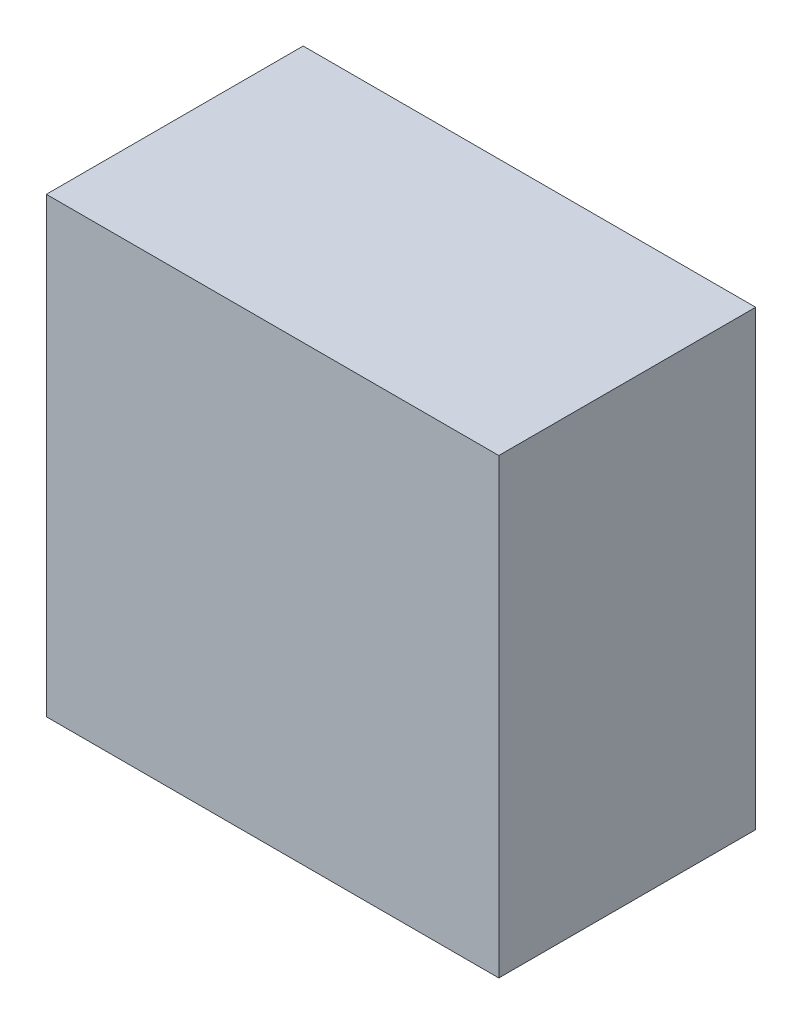
ISO-10303-21;
HEADER;
FILE_DESCRIPTION(('STEP AP214'),'2;1');
FILE_NAME('part.step','',(''),(''),'','','');
FILE_SCHEMA(('AUTOMOTIVE_DESIGN { 1 0 10303 214 1 1 1 1 }'));
ENDSEC;
DATA;
#1=APPLICATION_CONTEXT('core data for automotive mechanical design processes');
#2=APPLICATION_PROTOCOL_DEFINITION('international standard','automotive_design',2000,#1);
#3=PRODUCT_CONTEXT('',#1,'mechanical');
#4=PRODUCT('Part','Part','',(#3));
#5=PRODUCT_RELATED_PRODUCT_CATEGORY('part','',(#4));
#6=PRODUCT_DEFINITION_FORMATION('','',#4);
#7=PRODUCT_DEFINITION_CONTEXT('part definition',#1,'design');
#8=PRODUCT_DEFINITION('design','',#6,#7);
#9=PRODUCT_DEFINITION_SHAPE('','',#8);
#10=(LENGTH_UNIT() NAMED_UNIT(*) SI_UNIT(.MILLI.,.METRE.));
#11=(NAMED_UNIT(*) PLANE_ANGLE_UNIT() SI_UNIT($,.RADIAN.));
#12=(NAMED_UNIT(*) SI_UNIT($,.STERADIAN.) SOLID_ANGLE_UNIT());
#13=UNCERTAINTY_MEASURE_WITH_UNIT(LENGTH_MEASURE(1.E-05),#10,'distance_accuracy_value','');
#14=(GEOMETRIC_REPRESENTATION_CONTEXT(3) GLOBAL_UNCERTAINTY_ASSIGNED_CONTEXT((#13)) GLOBAL_UNIT_ASSIGNED_CONTEXT((#10,
#11,#12)) REPRESENTATION_CONTEXT('',''));
#15=CARTESIAN_POINT('',(0.,0.,0.));
#16=DIRECTION('',(0.,0.,1.));
#17=DIRECTION('',(1.,0.,0.));
#18=AXIS2_PLACEMENT_3D('',#15,#16,#17);
#19=CARTESIAN_POINT('',(-3.12699908,-3.12699908,3.55));
#20=DIRECTION('',(0.,0.,1.));
#21=DIRECTION('',(1.,0.,0.));
#22=AXIS2_PLACEMENT_3D('',#19,#20,#21);
#23=PLANE('',#22);
#24=DIRECTION('',(1.,0.,0.));
#25=VECTOR('',#24,1.);
#26=CARTESIAN_POINT('',(-3.12699908,3.12699908,3.55));
#27=LINE('',#26,#25);
#28=CARTESIAN_POINT('',(-3.12699908,3.12699908,3.55));
#29=VERTEX_POINT('',#28);
#30=CARTESIAN_POINT('',(3.12699908,3.12699908,3.55));
#31=VERTEX_POINT('',#30);
#32=EDGE_CURVE('E52',#29,#31,#27,.T.);
#33=ORIENTED_EDGE('',*,*,#32,.F.);
#34=DIRECTION('',(0.,1.,0.));
#35=VECTOR('',#34,1.);
#36=CARTESIAN_POINT('',(-3.12699908,-3.12699908,3.55));
#37=LINE('',#36,#35);
#38=CARTESIAN_POINT('',(-3.12699908,-3.12699908,3.55));
#39=VERTEX_POINT('',#38);
#40=EDGE_CURVE('E67',#39,#29,#37,.T.);
#41=ORIENTED_EDGE('',*,*,#40,.F.);
#42=DIRECTION('',(1.,0.,0.));
#43=VECTOR('',#42,1.);
#44=CARTESIAN_POINT('',(3.12699908,-3.12699908,3.55));
#45=LINE('',#44,#43);
#46=CARTESIAN_POINT('',(3.12699908,-3.12699908,3.55));
#47=VERTEX_POINT('',#46);
#48=EDGE_CURVE('E19',#47,#39,#45,.F.);
#49=ORIENTED_EDGE('',*,*,#48,.F.);
#50=DIRECTION('',(0.,1.,0.));
#51=VECTOR('',#50,1.);
#52=CARTESIAN_POINT('',(3.12699908,3.12699908,3.55));
#53=LINE('',#52,#51);
#54=EDGE_CURVE('E57',#31,#47,#53,.F.);
#55=ORIENTED_EDGE('',*,*,#54,.F.);
#56=EDGE_LOOP('',(#33,#41,#49,#55));
#57=FACE_BOUND('',#56,.T.);
#58=ADVANCED_FACE('F16',(#57),#23,.T.);
#59=CARTESIAN_POINT('',(3.12699908,-3.12699908,0.));
#60=DIRECTION('',(0.,-1.,0.));
#61=DIRECTION('',(0.,0.,-1.));
#62=AXIS2_PLACEMENT_3D('',#59,#60,#61);
#63=PLANE('',#62);
#64=DIRECTION('',(0.,0.,1.));
#65=VECTOR('',#64,1.);
#66=CARTESIAN_POINT('',(-3.12699908,-3.12699908,0.));
#67=LINE('',#66,#65);
#68=CARTESIAN_POINT('',(-3.12699908,-3.12699908,0.));
#69=VERTEX_POINT('',#68);
#70=EDGE_CURVE('E78',#69,#39,#67,.T.);
#71=ORIENTED_EDGE('',*,*,#70,.F.);
#72=DIRECTION('',(1.,0.,0.));
#73=VECTOR('',#72,1.);
#74=CARTESIAN_POINT('',(-3.12699908,-3.12699908,0.));
#75=LINE('',#74,#73);
#76=CARTESIAN_POINT('',(3.12699908,-3.12699908,0.));
#77=VERTEX_POINT('',#76);
#78=EDGE_CURVE('E73',#69,#77,#75,.T.);
#79=ORIENTED_EDGE('',*,*,#78,.T.);
#80=DIRECTION('',(0.,0.,-1.));
#81=VECTOR('',#80,1.);
#82=CARTESIAN_POINT('',(3.12699908,-3.12699908,0.));
#83=LINE('',#82,#81);
#84=EDGE_CURVE('E62',#47,#77,#83,.T.);
#85=ORIENTED_EDGE('',*,*,#84,.F.);
#86=ORIENTED_EDGE('',*,*,#48,.T.);
#87=EDGE_LOOP('',(#71,#79,#85,#86));
#88=FACE_BOUND('',#87,.T.);
#89=ADVANCED_FACE('F72',(#88),#63,.T.);
#90=CARTESIAN_POINT('',(3.12699908,3.12699908,0.));
#91=DIRECTION('',(1.,0.,0.));
#92=DIRECTION('',(0.,0.,-1.));
#93=AXIS2_PLACEMENT_3D('',#90,#91,#92);
#94=PLANE('',#93);
#95=ORIENTED_EDGE('',*,*,#84,.T.);
#96=DIRECTION('',(0.,1.,0.));
#97=VECTOR('',#96,1.);
#98=CARTESIAN_POINT('',(3.12699908,-3.12699908,0.));
#99=LINE('',#98,#97);
#100=CARTESIAN_POINT('',(3.12699908,3.12699908,0.));
#101=VERTEX_POINT('',#100);
#102=EDGE_CURVE('E83',#77,#101,#99,.T.);
#103=ORIENTED_EDGE('',*,*,#102,.T.);
#104=DIRECTION('',(0.,0.,1.));
#105=VECTOR('',#104,1.);
#106=CARTESIAN_POINT('',(3.12699908,3.12699908,0.));
#107=LINE('',#106,#105);
#108=EDGE_CURVE('E64',#31,#101,#107,.F.);
#109=ORIENTED_EDGE('',*,*,#108,.F.);
#110=ORIENTED_EDGE('',*,*,#54,.T.);
#111=EDGE_LOOP('',(#95,#103,#109,#110));
#112=FACE_BOUND('',#111,.T.);
#113=ADVANCED_FACE('F59',(#112),#94,.T.);
#114=CARTESIAN_POINT('',(-3.12699908,3.12699908,0.));
#115=DIRECTION('',(0.,1.,0.));
#116=DIRECTION('',(0.,0.,1.));
#117=AXIS2_PLACEMENT_3D('',#114,#115,#116);
#118=PLANE('',#117);
#119=ORIENTED_EDGE('',*,*,#108,.T.);
#120=DIRECTION('',(1.,0.,0.));
#121=VECTOR('',#120,1.);
#122=CARTESIAN_POINT('',(-3.12699908,3.12699908,0.));
#123=LINE('',#122,#121);
#124=CARTESIAN_POINT('',(-3.12699908,3.12699908,0.));
#125=VERTEX_POINT('',#124);
#126=EDGE_CURVE('E25',#101,#125,#123,.F.);
#127=ORIENTED_EDGE('',*,*,#126,.T.);
#128=DIRECTION('',(0.,0.,1.));
#129=VECTOR('',#128,1.);
#130=CARTESIAN_POINT('',(-3.12699908,3.12699908,0.));
#131=LINE('',#130,#129);
#132=EDGE_CURVE('E33',#29,#125,#131,.F.);
#133=ORIENTED_EDGE('',*,*,#132,.F.);
#134=ORIENTED_EDGE('',*,*,#32,.T.);
#135=EDGE_LOOP('',(#119,#127,#133,#134));
#136=FACE_BOUND('',#135,.T.);
#137=ADVANCED_FACE('F87',(#136),#118,.T.);
#138=CARTESIAN_POINT('',(-3.12699908,-3.12699908,0.));
#139=DIRECTION('',(-1.,0.,0.));
#140=DIRECTION('',(0.,0.,1.));
#141=AXIS2_PLACEMENT_3D('',#138,#139,#140);
#142=PLANE('',#141);
#143=ORIENTED_EDGE('',*,*,#132,.T.);
#144=DIRECTION('',(0.,1.,0.));
#145=VECTOR('',#144,1.);
#146=CARTESIAN_POINT('',(-3.12699908,-3.12699908,0.));
#147=LINE('',#146,#145);
#148=EDGE_CURVE('E11',#125,#69,#147,.F.);
#149=ORIENTED_EDGE('',*,*,#148,.T.);
#150=ORIENTED_EDGE('',*,*,#70,.T.);
#151=ORIENTED_EDGE('',*,*,#40,.T.);
#152=EDGE_LOOP('',(#143,#149,#150,#151));
#153=FACE_BOUND('',#152,.T.);
#154=ADVANCED_FACE('F90',(#153),#142,.T.);
#155=CARTESIAN_POINT('',(-3.12699908,-3.12699908,0.));
#156=DIRECTION('',(0.,0.,1.));
#157=DIRECTION('',(1.,0.,0.));
#158=AXIS2_PLACEMENT_3D('',#155,#156,#157);
#159=PLANE('',#158);
#160=ORIENTED_EDGE('',*,*,#126,.F.);
#161=ORIENTED_EDGE('',*,*,#102,.F.);
#162=ORIENTED_EDGE('',*,*,#78,.F.);
#163=ORIENTED_EDGE('',*,*,#148,.F.);
#164=EDGE_LOOP('',(#160,#161,#162,#163));
#165=FACE_BOUND('',#164,.T.);
#166=ADVANCED_FACE('F89',(#165),#159,.F.);
#167=CLOSED_SHELL('',(#58,#89,#113,#137,#154,#166));
#168=MANIFOLD_SOLID_BREP('B1',#167);
#169=ADVANCED_BREP_SHAPE_REPRESENTATION('',(#18,#168),#14);
#170=SHAPE_DEFINITION_REPRESENTATION(#9,#169);
ENDSEC;
END-ISO-10303-21;
